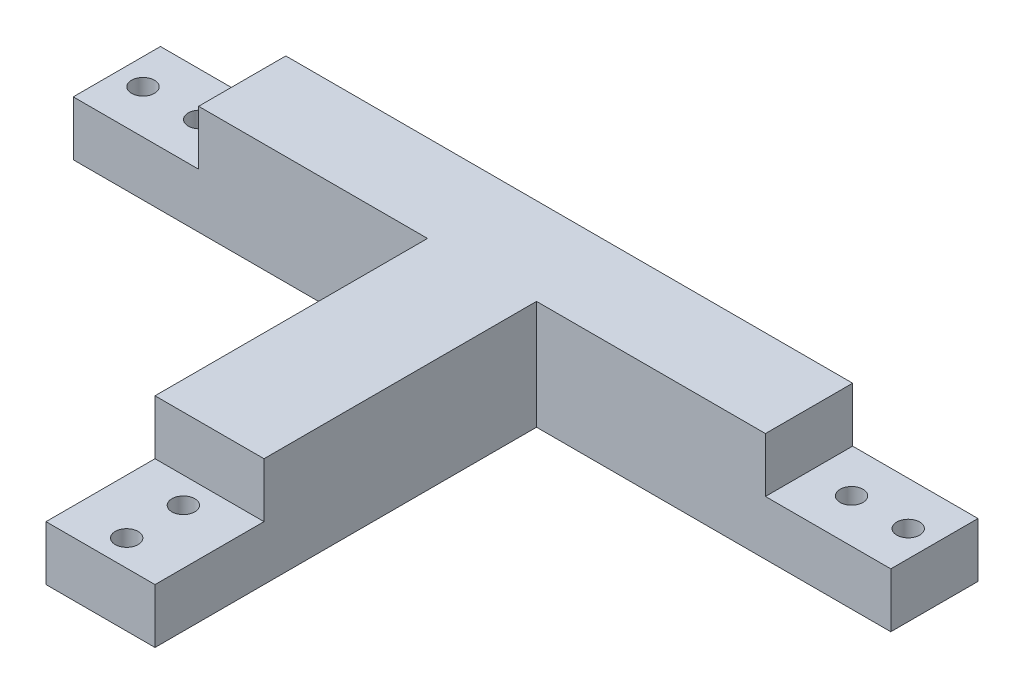
ISO-10303-21;
HEADER;
FILE_DESCRIPTION(('STEP AP214'),'2;1');
FILE_NAME('part.step','',(''),(''),'','','');
FILE_SCHEMA(('AUTOMOTIVE_DESIGN { 1 0 10303 214 1 1 1 1 }'));
ENDSEC;
DATA;
#1=APPLICATION_CONTEXT('core data for automotive mechanical design processes');
#2=APPLICATION_PROTOCOL_DEFINITION('international standard','automotive_design',2000,#1);
#3=PRODUCT_CONTEXT('',#1,'mechanical');
#4=PRODUCT('Part','Part','',(#3));
#5=PRODUCT_RELATED_PRODUCT_CATEGORY('part','',(#4));
#6=PRODUCT_DEFINITION_FORMATION('','',#4);
#7=PRODUCT_DEFINITION_CONTEXT('part definition',#1,'design');
#8=PRODUCT_DEFINITION('design','',#6,#7);
#9=PRODUCT_DEFINITION_SHAPE('','',#8);
#10=(LENGTH_UNIT() NAMED_UNIT(*) SI_UNIT(.MILLI.,.METRE.));
#11=(NAMED_UNIT(*) PLANE_ANGLE_UNIT() SI_UNIT($,.RADIAN.));
#12=(NAMED_UNIT(*) SI_UNIT($,.STERADIAN.) SOLID_ANGLE_UNIT());
#13=UNCERTAINTY_MEASURE_WITH_UNIT(LENGTH_MEASURE(1.E-05),#10,'distance_accuracy_value','');
#14=(GEOMETRIC_REPRESENTATION_CONTEXT(3) GLOBAL_UNCERTAINTY_ASSIGNED_CONTEXT((#13)) GLOBAL_UNIT_ASSIGNED_CONTEXT((#10,
#11,#12)) REPRESENTATION_CONTEXT('',''));
#15=CARTESIAN_POINT('',(0.,0.,0.));
#16=DIRECTION('',(0.,0.,1.));
#17=DIRECTION('',(1.,0.,0.));
#18=AXIS2_PLACEMENT_3D('',#15,#16,#17);
#19=CARTESIAN_POINT('',(75.,10.,7.99999999999999));
#20=DIRECTION('',(0.,0.,1.));
#21=DIRECTION('',(1.,0.,0.));
#22=AXIS2_PLACEMENT_3D('',#19,#20,#21);
#23=PLANE('',#22);
#24=DIRECTION('',(0.,1.,0.));
#25=VECTOR('',#24,1.);
#26=CARTESIAN_POINT('',(-52.,10.,8.00000000000001));
#27=LINE('',#26,#25);
#28=CARTESIAN_POINT('',(-52.,10.,8.00000000000001));
#29=VERTEX_POINT('',#28);
#30=CARTESIAN_POINT('',(-52.,20.,8.00000000000001));
#31=VERTEX_POINT('',#30);
#32=EDGE_CURVE('E52',#29,#31,#27,.T.);
#33=ORIENTED_EDGE('',*,*,#32,.F.);
#34=DIRECTION('',(-1.,0.,0.));
#35=VECTOR('',#34,1.);
#36=CARTESIAN_POINT('',(75.,10.,7.99999999999999));
#37=LINE('',#36,#35);
#38=CARTESIAN_POINT('',(-75.,10.,8.00000000000001));
#39=VERTEX_POINT('',#38);
#40=EDGE_CURVE('E140',#29,#39,#37,.T.);
#41=ORIENTED_EDGE('',*,*,#40,.T.);
#42=DIRECTION('',(0.,-1.,0.));
#43=VECTOR('',#42,1.);
#44=CARTESIAN_POINT('',(-75.,10.,8.00000000000001));
#45=LINE('',#44,#43);
#46=CARTESIAN_POINT('',(-75.,0.,8.00000000000001));
#47=VERTEX_POINT('',#46);
#48=EDGE_CURVE('E278',#39,#47,#45,.T.);
#49=ORIENTED_EDGE('',*,*,#48,.T.);
#50=DIRECTION('',(-1.,0.,0.));
#51=VECTOR('',#50,1.);
#52=CARTESIAN_POINT('',(75.,0.,7.99999999999999));
#53=LINE('',#52,#51);
#54=CARTESIAN_POINT('',(-9.99999999999999,0.,8.));
#55=VERTEX_POINT('',#54);
#56=EDGE_CURVE('E274',#55,#47,#53,.T.);
#57=ORIENTED_EDGE('',*,*,#56,.F.);
#58=DIRECTION('',(0.,-1.,0.));
#59=VECTOR('',#58,1.);
#60=CARTESIAN_POINT('',(-10.,0.,8.));
#61=LINE('',#60,#59);
#62=CARTESIAN_POINT('',(-10.,20.,8.));
#63=VERTEX_POINT('',#62);
#64=EDGE_CURVE('E203',#63,#55,#61,.T.);
#65=ORIENTED_EDGE('',*,*,#64,.F.);
#66=DIRECTION('',(1.,0.,0.));
#67=VECTOR('',#66,1.);
#68=CARTESIAN_POINT('',(0.,20.,8.));
#69=LINE('',#68,#67);
#70=EDGE_CURVE('E158',#31,#63,#69,.T.);
#71=ORIENTED_EDGE('',*,*,#70,.F.);
#72=EDGE_LOOP('',(#33,#41,#49,#57,#65,#71));
#73=FACE_BOUND('',#72,.T.);
#74=ADVANCED_FACE('F37',(#73),#23,.T.);
#75=CARTESIAN_POINT('',(0.,10.,0.));
#76=DIRECTION('',(0.,1.,0.));
#77=DIRECTION('',(0.,0.,1.));
#78=AXIS2_PLACEMENT_3D('',#75,#76,#77);
#79=PLANE('',#78);
#80=CARTESIAN_POINT('',(59.8,10.,0.));
#81=DIRECTION('',(0.,1.,0.));
#82=DIRECTION('',(0.,0.,1.));
#83=AXIS2_PLACEMENT_3D('',#80,#81,#82);
#84=CIRCLE('',#83,2.09999999999999);
#85=CARTESIAN_POINT('',(59.8,10.,2.09999999999999));
#86=VERTEX_POINT('',#85);
#87=EDGE_CURVE('E232',#86,#86,#84,.T.);
#88=ORIENTED_EDGE('',*,*,#87,.F.);
#89=EDGE_LOOP('',(#88));
#90=FACE_BOUND('',#89,.T.);
#91=CARTESIAN_POINT('',(70.2,10.,0.));
#92=DIRECTION('',(0.,1.,0.));
#93=DIRECTION('',(0.,0.,1.));
#94=AXIS2_PLACEMENT_3D('',#91,#92,#93);
#95=CIRCLE('',#94,2.1);
#96=CARTESIAN_POINT('',(70.2,10.,2.1));
#97=VERTEX_POINT('',#96);
#98=EDGE_CURVE('E227',#97,#97,#95,.T.);
#99=ORIENTED_EDGE('',*,*,#98,.F.);
#100=EDGE_LOOP('',(#99));
#101=FACE_BOUND('',#100,.T.);
#102=DIRECTION('',(-1.,0.,0.));
#103=VECTOR('',#102,1.);
#104=CARTESIAN_POINT('',(75.,10.,-8.00000000000001));
#105=LINE('',#104,#103);
#106=CARTESIAN_POINT('',(75.,10.,-8.00000000000001));
#107=VERTEX_POINT('',#106);
#108=CARTESIAN_POINT('',(52.,10.,-8.00000000000001));
#109=VERTEX_POINT('',#108);
#110=EDGE_CURVE('E262',#107,#109,#105,.T.);
#111=ORIENTED_EDGE('',*,*,#110,.T.);
#112=DIRECTION('',(0.,0.,1.));
#113=VECTOR('',#112,1.);
#114=CARTESIAN_POINT('',(52.,10.,-8.00000000000001));
#115=LINE('',#114,#113);
#116=CARTESIAN_POINT('',(52.,10.,8.));
#117=VERTEX_POINT('',#116);
#118=EDGE_CURVE('E164',#109,#117,#115,.T.);
#119=ORIENTED_EDGE('',*,*,#118,.T.);
#120=CARTESIAN_POINT('',(75.,10.,7.99999999999999));
#121=VERTEX_POINT('',#120);
#122=EDGE_CURVE('E148',#121,#117,#37,.T.);
#123=ORIENTED_EDGE('',*,*,#122,.F.);
#124=DIRECTION('',(0.,0.,-1.));
#125=VECTOR('',#124,1.);
#126=CARTESIAN_POINT('',(75.,10.,7.99999999999999));
#127=LINE('',#126,#125);
#128=EDGE_CURVE('E257',#121,#107,#127,.T.);
#129=ORIENTED_EDGE('',*,*,#128,.T.);
#130=EDGE_LOOP('',(#111,#119,#123,#129));
#131=FACE_BOUND('',#130,.T.);
#132=ADVANCED_FACE('F301',(#90,#101,#131),#79,.T.);
#133=CARTESIAN_POINT('',(75.,10.,7.99999999999999));
#134=DIRECTION('',(-1.,0.,0.));
#135=DIRECTION('',(0.,0.,1.));
#136=AXIS2_PLACEMENT_3D('',#133,#134,#135);
#137=PLANE('',#136);
#138=DIRECTION('',(0.,0.,-1.));
#139=VECTOR('',#138,1.);
#140=CARTESIAN_POINT('',(75.,0.,7.99999999999999));
#141=LINE('',#140,#139);
#142=CARTESIAN_POINT('',(75.,0.,7.99999999999999));
#143=VERTEX_POINT('',#142);
#144=CARTESIAN_POINT('',(75.,0.,-8.00000000000001));
#145=VERTEX_POINT('',#144);
#146=EDGE_CURVE('E256',#143,#145,#141,.T.);
#147=ORIENTED_EDGE('',*,*,#146,.T.);
#148=DIRECTION('',(0.,-1.,0.));
#149=VECTOR('',#148,1.);
#150=CARTESIAN_POINT('',(75.,10.,-8.00000000000001));
#151=LINE('',#150,#149);
#152=EDGE_CURVE('E11',#107,#145,#151,.T.);
#153=ORIENTED_EDGE('',*,*,#152,.F.);
#154=ORIENTED_EDGE('',*,*,#128,.F.);
#155=DIRECTION('',(0.,-1.,0.));
#156=VECTOR('',#155,1.);
#157=CARTESIAN_POINT('',(75.,10.,7.99999999999999));
#158=LINE('',#157,#156);
#159=EDGE_CURVE('E265',#121,#143,#158,.T.);
#160=ORIENTED_EDGE('',*,*,#159,.T.);
#161=EDGE_LOOP('',(#147,#153,#154,#160));
#162=FACE_BOUND('',#161,.T.);
#163=ADVANCED_FACE('F39',(#162),#137,.F.);
#164=CARTESIAN_POINT('',(75.,10.,-8.00000000000001));
#165=DIRECTION('',(0.,0.,1.));
#166=DIRECTION('',(1.,0.,0.));
#167=AXIS2_PLACEMENT_3D('',#164,#165,#166);
#168=PLANE('',#167);
#169=CARTESIAN_POINT('',(-52.,10.,-7.99999999999999));
#170=VERTEX_POINT('',#169);
#171=CARTESIAN_POINT('',(-75.,10.,-7.99999999999999));
#172=VERTEX_POINT('',#171);
#173=EDGE_CURVE('E260',#170,#172,#105,.T.);
#174=ORIENTED_EDGE('',*,*,#173,.F.);
#175=DIRECTION('',(0.,1.,0.));
#176=VECTOR('',#175,1.);
#177=CARTESIAN_POINT('',(-52.,10.,-7.99999999999999));
#178=LINE('',#177,#176);
#179=CARTESIAN_POINT('',(-52.,20.,-7.99999999999999));
#180=VERTEX_POINT('',#179);
#181=EDGE_CURVE('E153',#170,#180,#178,.T.);
#182=ORIENTED_EDGE('',*,*,#181,.T.);
#183=DIRECTION('',(-1.,0.,0.));
#184=VECTOR('',#183,1.);
#185=CARTESIAN_POINT('',(0.,20.,-8.));
#186=LINE('',#185,#184);
#187=CARTESIAN_POINT('',(52.,20.,-8.));
#188=VERTEX_POINT('',#187);
#189=EDGE_CURVE('E243',#188,#180,#186,.T.);
#190=ORIENTED_EDGE('',*,*,#189,.F.);
#191=DIRECTION('',(0.,1.,0.));
#192=VECTOR('',#191,1.);
#193=CARTESIAN_POINT('',(52.,10.,-8.00000000000001));
#194=LINE('',#193,#192);
#195=EDGE_CURVE('E60',#109,#188,#194,.T.);
#196=ORIENTED_EDGE('',*,*,#195,.F.);
#197=ORIENTED_EDGE('',*,*,#110,.F.);
#198=ORIENTED_EDGE('',*,*,#152,.T.);
#199=DIRECTION('',(-1.,0.,0.));
#200=VECTOR('',#199,1.);
#201=CARTESIAN_POINT('',(75.,0.,-8.00000000000001));
#202=LINE('',#201,#200);
#203=CARTESIAN_POINT('',(-75.,0.,-7.99999999999999));
#204=VERTEX_POINT('',#203);
#205=EDGE_CURVE('E268',#145,#204,#202,.T.);
#206=ORIENTED_EDGE('',*,*,#205,.T.);
#207=DIRECTION('',(0.,-1.,0.));
#208=VECTOR('',#207,1.);
#209=CARTESIAN_POINT('',(-75.,10.,-7.99999999999999));
#210=LINE('',#209,#208);
#211=EDGE_CURVE('E45',#172,#204,#210,.T.);
#212=ORIENTED_EDGE('',*,*,#211,.F.);
#213=EDGE_LOOP('',(#174,#182,#190,#196,#197,#198,#206,#212));
#214=FACE_BOUND('',#213,.T.);
#215=ADVANCED_FACE('F284',(#214),#168,.F.);
#216=CARTESIAN_POINT('',(-75.,10.,8.00000000000001));
#217=DIRECTION('',(-1.,0.,0.));
#218=DIRECTION('',(0.,0.,1.));
#219=AXIS2_PLACEMENT_3D('',#216,#217,#218);
#220=PLANE('',#219);
#221=DIRECTION('',(0.,0.,-1.));
#222=VECTOR('',#221,1.);
#223=CARTESIAN_POINT('',(-75.,0.,8.00000000000001));
#224=LINE('',#223,#222);
#225=EDGE_CURVE('E271',#47,#204,#224,.T.);
#226=ORIENTED_EDGE('',*,*,#225,.F.);
#227=ORIENTED_EDGE('',*,*,#48,.F.);
#228=DIRECTION('',(0.,0.,-1.));
#229=VECTOR('',#228,1.);
#230=CARTESIAN_POINT('',(-75.,10.,8.00000000000001));
#231=LINE('',#230,#229);
#232=EDGE_CURVE('E144',#39,#172,#231,.T.);
#233=ORIENTED_EDGE('',*,*,#232,.T.);
#234=ORIENTED_EDGE('',*,*,#211,.T.);
#235=EDGE_LOOP('',(#226,#227,#233,#234));
#236=FACE_BOUND('',#235,.T.);
#237=ADVANCED_FACE('F282',(#236),#220,.T.);
#238=DIRECTION('',(0.,1.,0.));
#239=VECTOR('',#238,1.);
#240=CARTESIAN_POINT('',(52.,10.,8.));
#241=LINE('',#240,#239);
#242=CARTESIAN_POINT('',(52.,20.,8.));
#243=VERTEX_POINT('',#242);
#244=EDGE_CURVE('E169',#117,#243,#241,.T.);
#245=ORIENTED_EDGE('',*,*,#244,.T.);
#246=CARTESIAN_POINT('',(10.,20.,8.));
#247=VERTEX_POINT('',#246);
#248=EDGE_CURVE('E254',#247,#243,#69,.T.);
#249=ORIENTED_EDGE('',*,*,#248,.F.);
#250=DIRECTION('',(0.,1.,0.));
#251=VECTOR('',#250,1.);
#252=CARTESIAN_POINT('',(10.,0.,8.));
#253=LINE('',#252,#251);
#254=CARTESIAN_POINT('',(9.99999999999999,0.,8.));
#255=VERTEX_POINT('',#254);
#256=EDGE_CURVE('E207',#255,#247,#253,.T.);
#257=ORIENTED_EDGE('',*,*,#256,.F.);
#258=EDGE_CURVE('E261',#143,#255,#53,.T.);
#259=ORIENTED_EDGE('',*,*,#258,.F.);
#260=ORIENTED_EDGE('',*,*,#159,.F.);
#261=ORIENTED_EDGE('',*,*,#122,.T.);
#262=EDGE_LOOP('',(#245,#249,#257,#259,#260,#261));
#263=FACE_BOUND('',#262,.T.);
#264=ADVANCED_FACE('F305',(#263),#23,.T.);
#265=CARTESIAN_POINT('',(-70.2,10.,0.));
#266=DIRECTION('',(0.,1.,0.));
#267=DIRECTION('',(0.,0.,1.));
#268=AXIS2_PLACEMENT_3D('',#265,#266,#267);
#269=CIRCLE('',#268,2.1);
#270=CARTESIAN_POINT('',(-70.2,10.,2.1));
#271=VERTEX_POINT('',#270);
#272=EDGE_CURVE('E244',#271,#271,#269,.T.);
#273=ORIENTED_EDGE('',*,*,#272,.F.);
#274=EDGE_LOOP('',(#273));
#275=FACE_BOUND('',#274,.T.);
#276=CARTESIAN_POINT('',(-59.8,10.,0.));
#277=DIRECTION('',(0.,1.,0.));
#278=DIRECTION('',(0.,0.,1.));
#279=AXIS2_PLACEMENT_3D('',#276,#277,#278);
#280=CIRCLE('',#279,2.1);
#281=CARTESIAN_POINT('',(-59.8,10.,2.1));
#282=VERTEX_POINT('',#281);
#283=EDGE_CURVE('E231',#282,#282,#280,.T.);
#284=ORIENTED_EDGE('',*,*,#283,.F.);
#285=EDGE_LOOP('',(#284));
#286=FACE_BOUND('',#285,.T.);
#287=ORIENTED_EDGE('',*,*,#40,.F.);
#288=DIRECTION('',(0.,0.,-1.));
#289=VECTOR('',#288,1.);
#290=CARTESIAN_POINT('',(-52.,10.,-7.99999999999999));
#291=LINE('',#290,#289);
#292=EDGE_CURVE('E142',#29,#170,#291,.T.);
#293=ORIENTED_EDGE('',*,*,#292,.T.);
#294=ORIENTED_EDGE('',*,*,#173,.T.);
#295=ORIENTED_EDGE('',*,*,#232,.F.);
#296=EDGE_LOOP('',(#287,#293,#294,#295));
#297=FACE_BOUND('',#296,.T.);
#298=ADVANCED_FACE('F141',(#275,#286,#297),#79,.T.);
#299=CARTESIAN_POINT('',(0.,0.,0.));
#300=DIRECTION('',(0.,1.,0.));
#301=DIRECTION('',(0.,0.,1.));
#302=AXIS2_PLACEMENT_3D('',#299,#300,#301);
#303=PLANE('',#302);
#304=CARTESIAN_POINT('',(0.,0.,62.8));
#305=DIRECTION('',(0.,1.,0.));
#306=DIRECTION('',(-1.,0.,0.));
#307=AXIS2_PLACEMENT_3D('',#304,#305,#306);
#308=CIRCLE('',#307,2.1);
#309=CARTESIAN_POINT('',(-2.1,0.,62.8));
#310=VERTEX_POINT('',#309);
#311=EDGE_CURVE('E173',#310,#310,#308,.T.);
#312=ORIENTED_EDGE('',*,*,#311,.T.);
#313=EDGE_LOOP('',(#312));
#314=FACE_BOUND('',#313,.T.);
#315=CARTESIAN_POINT('',(0.,0.,73.2));
#316=DIRECTION('',(0.,1.,0.));
#317=DIRECTION('',(-1.,0.,0.));
#318=AXIS2_PLACEMENT_3D('',#315,#316,#317);
#319=CIRCLE('',#318,2.1);
#320=CARTESIAN_POINT('',(-2.1,0.,73.2));
#321=VERTEX_POINT('',#320);
#322=EDGE_CURVE('E180',#321,#321,#319,.T.);
#323=ORIENTED_EDGE('',*,*,#322,.T.);
#324=EDGE_LOOP('',(#323));
#325=FACE_BOUND('',#324,.T.);
#326=CARTESIAN_POINT('',(59.8,0.,0.));
#327=DIRECTION('',(0.,1.,0.));
#328=DIRECTION('',(0.,0.,1.));
#329=AXIS2_PLACEMENT_3D('',#326,#327,#328);
#330=CIRCLE('',#329,2.09999999999999);
#331=CARTESIAN_POINT('',(59.8,0.,2.09999999999999));
#332=VERTEX_POINT('',#331);
#333=EDGE_CURVE('E228',#332,#332,#330,.T.);
#334=ORIENTED_EDGE('',*,*,#333,.T.);
#335=EDGE_LOOP('',(#334));
#336=FACE_BOUND('',#335,.T.);
#337=CARTESIAN_POINT('',(70.2,0.,0.));
#338=DIRECTION('',(0.,1.,0.));
#339=DIRECTION('',(0.,0.,1.));
#340=AXIS2_PLACEMENT_3D('',#337,#338,#339);
#341=CIRCLE('',#340,2.1);
#342=CARTESIAN_POINT('',(70.2,0.,2.1));
#343=VERTEX_POINT('',#342);
#344=EDGE_CURVE('E235',#343,#343,#341,.T.);
#345=ORIENTED_EDGE('',*,*,#344,.T.);
#346=EDGE_LOOP('',(#345));
#347=FACE_BOUND('',#346,.T.);
#348=CARTESIAN_POINT('',(-70.2,0.,0.));
#349=DIRECTION('',(0.,1.,0.));
#350=DIRECTION('',(0.,0.,1.));
#351=AXIS2_PLACEMENT_3D('',#348,#349,#350);
#352=CIRCLE('',#351,2.1);
#353=CARTESIAN_POINT('',(-70.2,0.,2.1));
#354=VERTEX_POINT('',#353);
#355=EDGE_CURVE('E240',#354,#354,#352,.T.);
#356=ORIENTED_EDGE('',*,*,#355,.T.);
#357=EDGE_LOOP('',(#356));
#358=FACE_BOUND('',#357,.T.);
#359=CARTESIAN_POINT('',(-59.8,0.,0.));
#360=DIRECTION('',(0.,1.,0.));
#361=DIRECTION('',(0.,0.,1.));
#362=AXIS2_PLACEMENT_3D('',#359,#360,#361);
#363=CIRCLE('',#362,2.1);
#364=CARTESIAN_POINT('',(-59.8,0.,2.1));
#365=VERTEX_POINT('',#364);
#366=EDGE_CURVE('E247',#365,#365,#363,.T.);
#367=ORIENTED_EDGE('',*,*,#366,.T.);
#368=EDGE_LOOP('',(#367));
#369=FACE_BOUND('',#368,.T.);
#370=ORIENTED_EDGE('',*,*,#146,.F.);
#371=ORIENTED_EDGE('',*,*,#258,.T.);
#372=DIRECTION('',(0.,0.,-1.));
#373=VECTOR('',#372,1.);
#374=CARTESIAN_POINT('',(10.,0.,58.));
#375=LINE('',#374,#373);
#376=CARTESIAN_POINT('',(9.99999999999999,0.,78.));
#377=VERTEX_POINT('',#376);
#378=EDGE_CURVE('E221',#377,#255,#375,.T.);
#379=ORIENTED_EDGE('',*,*,#378,.F.);
#380=DIRECTION('',(1.,0.,0.));
#381=VECTOR('',#380,1.);
#382=CARTESIAN_POINT('',(9.99999999999999,0.,78.));
#383=LINE('',#382,#381);
#384=CARTESIAN_POINT('',(-10.,0.,78.));
#385=VERTEX_POINT('',#384);
#386=EDGE_CURVE('E188',#385,#377,#383,.T.);
#387=ORIENTED_EDGE('',*,*,#386,.F.);
#388=DIRECTION('',(0.,0.,-1.));
#389=VECTOR('',#388,1.);
#390=CARTESIAN_POINT('',(-10.,0.,58.));
#391=LINE('',#390,#389);
#392=EDGE_CURVE('E224',#385,#55,#391,.T.);
#393=ORIENTED_EDGE('',*,*,#392,.T.);
#394=ORIENTED_EDGE('',*,*,#56,.T.);
#395=ORIENTED_EDGE('',*,*,#225,.T.);
#396=ORIENTED_EDGE('',*,*,#205,.F.);
#397=EDGE_LOOP('',(#370,#371,#379,#387,#393,#394,#395,#396));
#398=FACE_BOUND('',#397,.T.);
#399=ADVANCED_FACE('F288',(#314,#325,#336,#347,#358,#369,#398),#303,.F.);
#400=CARTESIAN_POINT('',(0.,20.,0.));
#401=DIRECTION('',(0.,1.,0.));
#402=DIRECTION('',(0.,0.,1.));
#403=AXIS2_PLACEMENT_3D('',#400,#401,#402);
#404=PLANE('',#403);
#405=DIRECTION('',(0.,0.,-1.));
#406=VECTOR('',#405,1.);
#407=CARTESIAN_POINT('',(-52.,20.,-7.99999999999999));
#408=LINE('',#407,#406);
#409=EDGE_CURVE('E154',#31,#180,#408,.T.);
#410=ORIENTED_EDGE('',*,*,#409,.F.);
#411=ORIENTED_EDGE('',*,*,#70,.T.);
#412=DIRECTION('',(0.,0.,-1.));
#413=VECTOR('',#412,1.);
#414=CARTESIAN_POINT('',(-10.,20.,58.));
#415=LINE('',#414,#413);
#416=CARTESIAN_POINT('',(-10.,20.,58.));
#417=VERTEX_POINT('',#416);
#418=EDGE_CURVE('E211',#417,#63,#415,.T.);
#419=ORIENTED_EDGE('',*,*,#418,.F.);
#420=DIRECTION('',(-1.,0.,0.));
#421=VECTOR('',#420,1.);
#422=CARTESIAN_POINT('',(10.,20.,58.));
#423=LINE('',#422,#421);
#424=CARTESIAN_POINT('',(10.,20.,58.));
#425=VERTEX_POINT('',#424);
#426=EDGE_CURVE('E209',#425,#417,#423,.T.);
#427=ORIENTED_EDGE('',*,*,#426,.F.);
#428=DIRECTION('',(0.,0.,-1.));
#429=VECTOR('',#428,1.);
#430=CARTESIAN_POINT('',(10.,20.,58.));
#431=LINE('',#430,#429);
#432=EDGE_CURVE('E218',#425,#247,#431,.T.);
#433=ORIENTED_EDGE('',*,*,#432,.T.);
#434=ORIENTED_EDGE('',*,*,#248,.T.);
#435=DIRECTION('',(0.,0.,1.));
#436=VECTOR('',#435,1.);
#437=CARTESIAN_POINT('',(52.,20.,-8.00000000000001));
#438=LINE('',#437,#436);
#439=EDGE_CURVE('E167',#188,#243,#438,.T.);
#440=ORIENTED_EDGE('',*,*,#439,.F.);
#441=ORIENTED_EDGE('',*,*,#189,.T.);
#442=EDGE_LOOP('',(#410,#411,#419,#427,#433,#434,#440,#441));
#443=FACE_BOUND('',#442,.T.);
#444=ADVANCED_FACE('F296',(#443),#404,.T.);
#445=CARTESIAN_POINT('',(-59.8,0.,0.));
#446=DIRECTION('',(0.,1.,0.));
#447=DIRECTION('',(0.,0.,1.));
#448=AXIS2_PLACEMENT_3D('',#445,#446,#447);
#449=CYLINDRICAL_SURFACE('',#448,2.1);
#450=ORIENTED_EDGE('',*,*,#366,.F.);
#451=EDGE_LOOP('',(#450));
#452=FACE_BOUND('',#451,.T.);
#453=ORIENTED_EDGE('',*,*,#283,.T.);
#454=EDGE_LOOP('',(#453));
#455=FACE_BOUND('',#454,.T.);
#456=ADVANCED_FACE('F385',(#452,#455),#449,.F.);
#457=CARTESIAN_POINT('',(-70.2,0.,0.));
#458=DIRECTION('',(0.,1.,0.));
#459=DIRECTION('',(0.,0.,1.));
#460=AXIS2_PLACEMENT_3D('',#457,#458,#459);
#461=CYLINDRICAL_SURFACE('',#460,2.1);
#462=ORIENTED_EDGE('',*,*,#355,.F.);
#463=EDGE_LOOP('',(#462));
#464=FACE_BOUND('',#463,.T.);
#465=ORIENTED_EDGE('',*,*,#272,.T.);
#466=EDGE_LOOP('',(#465));
#467=FACE_BOUND('',#466,.T.);
#468=ADVANCED_FACE('F407',(#464,#467),#461,.F.);
#469=CARTESIAN_POINT('',(70.2,0.,0.));
#470=DIRECTION('',(0.,1.,0.));
#471=DIRECTION('',(0.,0.,1.));
#472=AXIS2_PLACEMENT_3D('',#469,#470,#471);
#473=CYLINDRICAL_SURFACE('',#472,2.1);
#474=ORIENTED_EDGE('',*,*,#344,.F.);
#475=EDGE_LOOP('',(#474));
#476=FACE_BOUND('',#475,.T.);
#477=ORIENTED_EDGE('',*,*,#98,.T.);
#478=EDGE_LOOP('',(#477));
#479=FACE_BOUND('',#478,.T.);
#480=ADVANCED_FACE('F415',(#476,#479),#473,.F.);
#481=CARTESIAN_POINT('',(59.8,0.,0.));
#482=DIRECTION('',(0.,1.,0.));
#483=DIRECTION('',(0.,0.,1.));
#484=AXIS2_PLACEMENT_3D('',#481,#482,#483);
#485=CYLINDRICAL_SURFACE('',#484,2.09999999999999);
#486=ORIENTED_EDGE('',*,*,#333,.F.);
#487=EDGE_LOOP('',(#486));
#488=FACE_BOUND('',#487,.T.);
#489=ORIENTED_EDGE('',*,*,#87,.T.);
#490=EDGE_LOOP('',(#489));
#491=FACE_BOUND('',#490,.T.);
#492=ADVANCED_FACE('F423',(#488,#491),#485,.F.);
#493=CARTESIAN_POINT('',(-10.,0.,58.));
#494=DIRECTION('',(1.,0.,0.));
#495=DIRECTION('',(0.,0.,-1.));
#496=AXIS2_PLACEMENT_3D('',#493,#494,#495);
#497=PLANE('',#496);
#498=ORIENTED_EDGE('',*,*,#64,.T.);
#499=ORIENTED_EDGE('',*,*,#392,.F.);
#500=DIRECTION('',(0.,-1.,0.));
#501=VECTOR('',#500,1.);
#502=CARTESIAN_POINT('',(-10.,0.,78.));
#503=LINE('',#502,#501);
#504=CARTESIAN_POINT('',(-10.,10.,78.));
#505=VERTEX_POINT('',#504);
#506=EDGE_CURVE('E185',#505,#385,#503,.T.);
#507=ORIENTED_EDGE('',*,*,#506,.F.);
#508=DIRECTION('',(0.,0.,-1.));
#509=VECTOR('',#508,1.);
#510=CARTESIAN_POINT('',(-10.,10.,78.));
#511=LINE('',#510,#509);
#512=CARTESIAN_POINT('',(-10.,10.,58.));
#513=VERTEX_POINT('',#512);
#514=EDGE_CURVE('E195',#505,#513,#511,.T.);
#515=ORIENTED_EDGE('',*,*,#514,.T.);
#516=DIRECTION('',(0.,-1.,0.));
#517=VECTOR('',#516,1.);
#518=CARTESIAN_POINT('',(-10.,0.,58.));
#519=LINE('',#518,#517);
#520=EDGE_CURVE('E204',#417,#513,#519,.T.);
#521=ORIENTED_EDGE('',*,*,#520,.F.);
#522=ORIENTED_EDGE('',*,*,#418,.T.);
#523=EDGE_LOOP('',(#498,#499,#507,#515,#521,#522));
#524=FACE_BOUND('',#523,.T.);
#525=ADVANCED_FACE('F293',(#524),#497,.F.);
#526=CARTESIAN_POINT('',(10.,0.,58.));
#527=DIRECTION('',(-1.,0.,0.));
#528=DIRECTION('',(0.,0.,1.));
#529=AXIS2_PLACEMENT_3D('',#526,#527,#528);
#530=PLANE('',#529);
#531=ORIENTED_EDGE('',*,*,#256,.T.);
#532=ORIENTED_EDGE('',*,*,#432,.F.);
#533=DIRECTION('',(0.,1.,0.));
#534=VECTOR('',#533,1.);
#535=CARTESIAN_POINT('',(10.,0.,58.));
#536=LINE('',#535,#534);
#537=CARTESIAN_POINT('',(10.,10.,58.));
#538=VERTEX_POINT('',#537);
#539=EDGE_CURVE('E206',#538,#425,#536,.T.);
#540=ORIENTED_EDGE('',*,*,#539,.F.);
#541=DIRECTION('',(0.,0.,-1.));
#542=VECTOR('',#541,1.);
#543=CARTESIAN_POINT('',(10.,10.,78.));
#544=LINE('',#543,#542);
#545=CARTESIAN_POINT('',(10.,10.,78.));
#546=VERTEX_POINT('',#545);
#547=EDGE_CURVE('E200',#546,#538,#544,.T.);
#548=ORIENTED_EDGE('',*,*,#547,.F.);
#549=DIRECTION('',(0.,1.,0.));
#550=VECTOR('',#549,1.);
#551=CARTESIAN_POINT('',(10.,10.,78.));
#552=LINE('',#551,#550);
#553=EDGE_CURVE('E191',#377,#546,#552,.T.);
#554=ORIENTED_EDGE('',*,*,#553,.F.);
#555=ORIENTED_EDGE('',*,*,#378,.T.);
#556=EDGE_LOOP('',(#531,#532,#540,#548,#554,#555));
#557=FACE_BOUND('',#556,.T.);
#558=ADVANCED_FACE('F309',(#557),#530,.F.);
#559=CARTESIAN_POINT('',(0.,0.,58.));
#560=DIRECTION('',(0.,0.,1.));
#561=DIRECTION('',(1.,0.,0.));
#562=AXIS2_PLACEMENT_3D('',#559,#560,#561);
#563=PLANE('',#562);
#564=DIRECTION('',(-1.,0.,0.));
#565=VECTOR('',#564,1.);
#566=CARTESIAN_POINT('',(-10.,10.,58.));
#567=LINE('',#566,#565);
#568=EDGE_CURVE('E176',#538,#513,#567,.T.);
#569=ORIENTED_EDGE('',*,*,#568,.F.);
#570=ORIENTED_EDGE('',*,*,#539,.T.);
#571=ORIENTED_EDGE('',*,*,#426,.T.);
#572=ORIENTED_EDGE('',*,*,#520,.T.);
#573=EDGE_LOOP('',(#569,#570,#571,#572));
#574=FACE_BOUND('',#573,.T.);
#575=ADVANCED_FACE('F444',(#574),#563,.T.);
#576=CARTESIAN_POINT('',(-10.,10.,78.));
#577=DIRECTION('',(0.,-1.,0.));
#578=DIRECTION('',(1.,0.,0.));
#579=AXIS2_PLACEMENT_3D('',#576,#577,#578);
#580=PLANE('',#579);
#581=CARTESIAN_POINT('',(0.,10.,62.8));
#582=DIRECTION('',(0.,1.,0.));
#583=DIRECTION('',(-1.,0.,0.));
#584=AXIS2_PLACEMENT_3D('',#581,#582,#583);
#585=CIRCLE('',#584,2.1);
#586=CARTESIAN_POINT('',(-2.1,10.,62.8));
#587=VERTEX_POINT('',#586);
#588=EDGE_CURVE('E177',#587,#587,#585,.T.);
#589=ORIENTED_EDGE('',*,*,#588,.F.);
#590=EDGE_LOOP('',(#589));
#591=FACE_BOUND('',#590,.T.);
#592=CARTESIAN_POINT('',(0.,10.,73.2));
#593=DIRECTION('',(0.,1.,0.));
#594=DIRECTION('',(-1.,0.,0.));
#595=AXIS2_PLACEMENT_3D('',#592,#593,#594);
#596=CIRCLE('',#595,2.1);
#597=CARTESIAN_POINT('',(-2.1,10.,73.2));
#598=VERTEX_POINT('',#597);
#599=EDGE_CURVE('E160',#598,#598,#596,.T.);
#600=ORIENTED_EDGE('',*,*,#599,.F.);
#601=EDGE_LOOP('',(#600));
#602=FACE_BOUND('',#601,.T.);
#603=ORIENTED_EDGE('',*,*,#568,.T.);
#604=ORIENTED_EDGE('',*,*,#514,.F.);
#605=DIRECTION('',(-1.,0.,0.));
#606=VECTOR('',#605,1.);
#607=CARTESIAN_POINT('',(-10.,10.,78.));
#608=LINE('',#607,#606);
#609=EDGE_CURVE('E193',#546,#505,#608,.T.);
#610=ORIENTED_EDGE('',*,*,#609,.F.);
#611=ORIENTED_EDGE('',*,*,#547,.T.);
#612=EDGE_LOOP('',(#603,#604,#610,#611));
#613=FACE_BOUND('',#612,.T.);
#614=ADVANCED_FACE('F451',(#591,#602,#613),#580,.F.);
#615=CARTESIAN_POINT('',(0.,0.,78.));
#616=DIRECTION('',(0.,0.,-1.));
#617=DIRECTION('',(-1.,0.,0.));
#618=AXIS2_PLACEMENT_3D('',#615,#616,#617);
#619=PLANE('',#618);
#620=ORIENTED_EDGE('',*,*,#506,.T.);
#621=ORIENTED_EDGE('',*,*,#386,.T.);
#622=ORIENTED_EDGE('',*,*,#553,.T.);
#623=ORIENTED_EDGE('',*,*,#609,.T.);
#624=EDGE_LOOP('',(#620,#621,#622,#623));
#625=FACE_BOUND('',#624,.T.);
#626=ADVANCED_FACE('F460',(#625),#619,.F.);
#627=CARTESIAN_POINT('',(0.,0.,73.2));
#628=DIRECTION('',(0.,1.,0.));
#629=DIRECTION('',(-1.,0.,0.));
#630=AXIS2_PLACEMENT_3D('',#627,#628,#629);
#631=CYLINDRICAL_SURFACE('',#630,2.1);
#632=ORIENTED_EDGE('',*,*,#322,.F.);
#633=EDGE_LOOP('',(#632));
#634=FACE_BOUND('',#633,.T.);
#635=ORIENTED_EDGE('',*,*,#599,.T.);
#636=EDGE_LOOP('',(#635));
#637=FACE_BOUND('',#636,.T.);
#638=ADVANCED_FACE('F322',(#634,#637),#631,.F.);
#639=CARTESIAN_POINT('',(0.,0.,62.8));
#640=DIRECTION('',(0.,1.,0.));
#641=DIRECTION('',(-1.,0.,0.));
#642=AXIS2_PLACEMENT_3D('',#639,#640,#641);
#643=CYLINDRICAL_SURFACE('',#642,2.1);
#644=ORIENTED_EDGE('',*,*,#311,.F.);
#645=EDGE_LOOP('',(#644));
#646=FACE_BOUND('',#645,.T.);
#647=ORIENTED_EDGE('',*,*,#588,.T.);
#648=EDGE_LOOP('',(#647));
#649=FACE_BOUND('',#648,.T.);
#650=ADVANCED_FACE('F315',(#646,#649),#643,.F.);
#651=CARTESIAN_POINT('',(52.,10.,-8.00000000000001));
#652=DIRECTION('',(-1.,0.,0.));
#653=DIRECTION('',(0.,0.,1.));
#654=AXIS2_PLACEMENT_3D('',#651,#652,#653);
#655=PLANE('',#654);
#656=ORIENTED_EDGE('',*,*,#439,.T.);
#657=ORIENTED_EDGE('',*,*,#244,.F.);
#658=ORIENTED_EDGE('',*,*,#118,.F.);
#659=ORIENTED_EDGE('',*,*,#195,.T.);
#660=EDGE_LOOP('',(#656,#657,#658,#659));
#661=FACE_BOUND('',#660,.T.);
#662=ADVANCED_FACE('F313',(#661),#655,.F.);
#663=CARTESIAN_POINT('',(-52.,10.,-7.99999999999999));
#664=DIRECTION('',(1.,0.,0.));
#665=DIRECTION('',(0.,0.,-1.));
#666=AXIS2_PLACEMENT_3D('',#663,#664,#665);
#667=PLANE('',#666);
#668=ORIENTED_EDGE('',*,*,#409,.T.);
#669=ORIENTED_EDGE('',*,*,#181,.F.);
#670=ORIENTED_EDGE('',*,*,#292,.F.);
#671=ORIENTED_EDGE('',*,*,#32,.T.);
#672=EDGE_LOOP('',(#668,#669,#670,#671));
#673=FACE_BOUND('',#672,.T.);
#674=ADVANCED_FACE('F151',(#673),#667,.F.);
#675=CLOSED_SHELL('',(#74,#132,#163,#215,#237,#264,#298,#399,#444,#456,#468,#480,#492,#525,#558,
#575,#614,#626,#638,#650,#662,#674));
#676=MANIFOLD_SOLID_BREP('B2',#675);
#677=ADVANCED_BREP_SHAPE_REPRESENTATION('',(#18,#676),#14);
#678=SHAPE_DEFINITION_REPRESENTATION(#9,#677);
ENDSEC;
END-ISO-10303-21;
